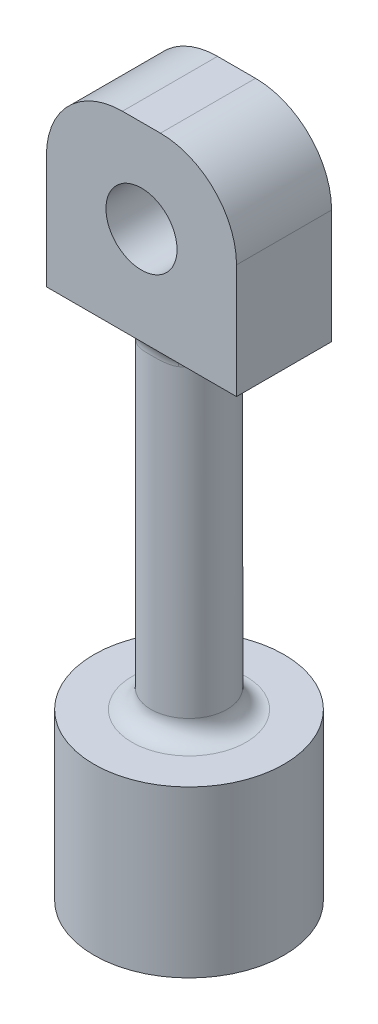
ISO-10303-21;
HEADER;
FILE_DESCRIPTION(('STEP AP214'),'2;1');
FILE_NAME('part.step','',(''),(''),'','','');
FILE_SCHEMA(('AUTOMOTIVE_DESIGN { 1 0 10303 214 1 1 1 1 }'));
ENDSEC;
DATA;
#1=APPLICATION_CONTEXT('core data for automotive mechanical design processes');
#2=APPLICATION_PROTOCOL_DEFINITION('international standard','automotive_design',2000,#1);
#3=PRODUCT_CONTEXT('',#1,'mechanical');
#4=PRODUCT('Part','Part','',(#3));
#5=PRODUCT_RELATED_PRODUCT_CATEGORY('part','',(#4));
#6=PRODUCT_DEFINITION_FORMATION('','',#4);
#7=PRODUCT_DEFINITION_CONTEXT('part definition',#1,'design');
#8=PRODUCT_DEFINITION('design','',#6,#7);
#9=PRODUCT_DEFINITION_SHAPE('','',#8);
#10=(LENGTH_UNIT() NAMED_UNIT(*) SI_UNIT(.MILLI.,.METRE.));
#11=(NAMED_UNIT(*) PLANE_ANGLE_UNIT() SI_UNIT($,.RADIAN.));
#12=(NAMED_UNIT(*) SI_UNIT($,.STERADIAN.) SOLID_ANGLE_UNIT());
#13=UNCERTAINTY_MEASURE_WITH_UNIT(LENGTH_MEASURE(1.E-05),#10,'distance_accuracy_value','');
#14=(GEOMETRIC_REPRESENTATION_CONTEXT(3) GLOBAL_UNCERTAINTY_ASSIGNED_CONTEXT((#13)) GLOBAL_UNIT_ASSIGNED_CONTEXT((#10,
#11,#12)) REPRESENTATION_CONTEXT('',''));
#15=CARTESIAN_POINT('',(0.,0.,0.));
#16=DIRECTION('',(0.,0.,1.));
#17=DIRECTION('',(1.,0.,0.));
#18=AXIS2_PLACEMENT_3D('',#15,#16,#17);
#19=CARTESIAN_POINT('',(0.,33.909,0.));
#20=DIRECTION('',(0.,-1.,0.));
#21=DIRECTION('',(0.,0.,-1.));
#22=AXIS2_PLACEMENT_3D('',#19,#20,#21);
#23=PLANE('',#22);
#24=DIRECTION('',(1.,0.,0.));
#25=VECTOR('',#24,1.);
#26=CARTESIAN_POINT('',(-6.35,33.909,3.175));
#27=LINE('',#26,#25);
#28=CARTESIAN_POINT('',(2.10605674187568,33.909,3.175));
#29=VERTEX_POINT('',#28);
#30=CARTESIAN_POINT('',(6.35,33.909,3.175));
#31=VERTEX_POINT('',#30);
#32=EDGE_CURVE('E149',#29,#31,#27,.T.);
#33=ORIENTED_EDGE('',*,*,#32,.F.);
#34=CARTESIAN_POINT('',(0.,33.909,0.));
#35=DIRECTION('',(0.,-1.,0.));
#36=DIRECTION('',(0.,0.,-1.));
#37=AXIS2_PLACEMENT_3D('',#34,#35,#36);
#38=CIRCLE('',#37,3.81);
#39=CARTESIAN_POINT('',(2.10605674187568,33.909,-3.175));
#40=VERTEX_POINT('',#39);
#41=EDGE_CURVE('E11',#29,#40,#38,.F.);
#42=ORIENTED_EDGE('',*,*,#41,.T.);
#43=DIRECTION('',(-1.,0.,0.));
#44=VECTOR('',#43,1.);
#45=CARTESIAN_POINT('',(-6.35,33.909,-3.175));
#46=LINE('',#45,#44);
#47=CARTESIAN_POINT('',(6.35,33.909,-3.175));
#48=VERTEX_POINT('',#47);
#49=EDGE_CURVE('E120',#48,#40,#46,.T.);
#50=ORIENTED_EDGE('',*,*,#49,.F.);
#51=DIRECTION('',(0.,0.,-1.));
#52=VECTOR('',#51,1.);
#53=CARTESIAN_POINT('',(6.35,33.909,3.175));
#54=LINE('',#53,#52);
#55=EDGE_CURVE('E130',#31,#48,#54,.T.);
#56=ORIENTED_EDGE('',*,*,#55,.F.);
#57=EDGE_LOOP('',(#33,#42,#50,#56));
#58=FACE_BOUND('',#57,.T.);
#59=ADVANCED_FACE('F35',(#58),#23,.T.);
#60=CARTESIAN_POINT('',(0.,11.049,0.));
#61=DIRECTION('',(0.,-1.,0.));
#62=DIRECTION('',(0.,0.,-1.));
#63=AXIS2_PLACEMENT_3D('',#60,#61,#62);
#64=CYLINDRICAL_SURFACE('',#63,6.35);
#65=CARTESIAN_POINT('',(0.,11.049,0.));
#66=DIRECTION('',(0.,1.,0.));
#67=DIRECTION('',(0.,0.,1.));
#68=AXIS2_PLACEMENT_3D('',#65,#66,#67);
#69=CIRCLE('',#68,6.35);
#70=CARTESIAN_POINT('',(0.,11.049,6.35));
#71=VERTEX_POINT('',#70);
#72=EDGE_CURVE('E160',#71,#71,#69,.T.);
#73=ORIENTED_EDGE('',*,*,#72,.F.);
#74=EDGE_LOOP('',(#73));
#75=FACE_BOUND('',#74,.T.);
#76=CARTESIAN_POINT('',(0.,0.,0.));
#77=DIRECTION('',(0.,1.,0.));
#78=DIRECTION('',(0.,0.,1.));
#79=AXIS2_PLACEMENT_3D('',#76,#77,#78);
#80=CIRCLE('',#79,6.35);
#81=CARTESIAN_POINT('',(0.,0.,6.35));
#82=VERTEX_POINT('',#81);
#83=EDGE_CURVE('E126',#82,#82,#80,.T.);
#84=ORIENTED_EDGE('',*,*,#83,.T.);
#85=EDGE_LOOP('',(#84));
#86=FACE_BOUND('',#85,.T.);
#87=ADVANCED_FACE('F308',(#75,#86),#64,.T.);
#88=CARTESIAN_POINT('',(0.,11.049,0.));
#89=DIRECTION('',(0.,1.,0.));
#90=DIRECTION('',(0.,0.,1.));
#91=AXIS2_PLACEMENT_3D('',#88,#89,#90);
#92=PLANE('',#91);
#93=CARTESIAN_POINT('',(0.,11.049,0.));
#94=DIRECTION('',(0.,1.,0.));
#95=DIRECTION('',(0.,0.,1.));
#96=AXIS2_PLACEMENT_3D('',#93,#94,#95);
#97=CIRCLE('',#96,3.81);
#98=CARTESIAN_POINT('',(0.,11.049,3.81));
#99=VERTEX_POINT('',#98);
#100=EDGE_CURVE('E271',#99,#99,#97,.F.);
#101=ORIENTED_EDGE('',*,*,#100,.T.);
#102=EDGE_LOOP('',(#101));
#103=FACE_BOUND('',#102,.T.);
#104=ORIENTED_EDGE('',*,*,#72,.T.);
#105=EDGE_LOOP('',(#104));
#106=FACE_BOUND('',#105,.T.);
#107=ADVANCED_FACE('F312',(#103,#106),#92,.T.);
#108=CARTESIAN_POINT('',(0.,0.,0.));
#109=DIRECTION('',(0.,1.,0.));
#110=DIRECTION('',(0.,0.,1.));
#111=AXIS2_PLACEMENT_3D('',#108,#109,#110);
#112=PLANE('',#111);
#113=ORIENTED_EDGE('',*,*,#83,.F.);
#114=EDGE_LOOP('',(#113));
#115=FACE_BOUND('',#114,.T.);
#116=ADVANCED_FACE('F318',(#115),#112,.F.);
#117=CARTESIAN_POINT('',(0.,33.909,0.));
#118=DIRECTION('',(0.,-1.,0.));
#119=DIRECTION('',(0.,0.,-1.));
#120=AXIS2_PLACEMENT_3D('',#117,#118,#119);
#121=CYLINDRICAL_SURFACE('',#120,2.54);
#122=CARTESIAN_POINT('',(0.,12.319,0.));
#123=DIRECTION('',(0.,1.,0.));
#124=DIRECTION('',(0.,0.,1.));
#125=AXIS2_PLACEMENT_3D('',#122,#123,#124);
#126=CIRCLE('',#125,2.54);
#127=CARTESIAN_POINT('',(0.,12.319,2.54));
#128=VERTEX_POINT('',#127);
#129=EDGE_CURVE('E274',#128,#128,#126,.T.);
#130=ORIENTED_EDGE('',*,*,#129,.T.);
#131=EDGE_LOOP('',(#130));
#132=FACE_BOUND('',#131,.T.);
#133=CARTESIAN_POINT('',(-2.75747346033165,33.909,3.175));
#134=CARTESIAN_POINT('',(-1.45075360666102,34.3925103205279,2.15924582636556));
#135=CARTESIAN_POINT('',(-1.8383156402211,32.762287335359,1.75276798433748));
#136=CARTESIAN_POINT('',(-2.72145797705879,33.909,3.175));
#137=CARTESIAN_POINT('',(-1.4619449534235,34.3627104337745,2.1364571380609));
#138=CARTESIAN_POINT('',(-1.81430531803398,32.7443061096109,1.77796123271911));
#139=CARTESIAN_POINT('',(-2.68412922378728,33.909,3.175));
#140=CARTESIAN_POINT('',(-1.47073248027829,34.3306632550964,2.11840312635964));
#141=CARTESIAN_POINT('',(-1.78941948251894,32.7287001018676,1.80301384779414));
#142=CARTESIAN_POINT('',(-2.60721213015224,33.909,3.175));
#143=CARTESIAN_POINT('',(-1.48263257214973,34.2651764844754,2.09138260314045));
#144=CARTESIAN_POINT('',(-1.73814142009749,32.7017579648089,1.85249078486686));
#145=CARTESIAN_POINT('',(-2.56762839040957,33.909,3.175));
#146=CARTESIAN_POINT('',(-1.48588018624446,34.231802792635,2.08220364788548));
#147=CARTESIAN_POINT('',(-1.71175226027164,32.6904134767656,1.87691624833565));
#148=CARTESIAN_POINT('',(-2.44674360913777,33.909,3.175));
#149=CARTESIAN_POINT('',(-1.48674334836591,34.1346097553019,2.06657196841838));
#150=CARTESIAN_POINT('',(-1.63116240609462,32.6621789642376,1.94833753668744));
#151=CARTESIAN_POINT('',(-2.3624790921311,33.909,3.175));
#152=CARTESIAN_POINT('',(-1.47653785253469,34.0706978369796,2.07020606843899));
#153=CARTESIAN_POINT('',(-1.57498606142162,32.6507044916589,1.99406237736209));
#154=CARTESIAN_POINT('',(-2.1410703829851,33.909,3.175));
#155=CARTESIAN_POINT('',(-1.42414088680289,33.9257559973822,2.10221098403041));
#156=CARTESIAN_POINT('',(-1.42738025532204,32.6351701860049,2.10395038816791));
#157=CARTESIAN_POINT('',(-1.99982997151836,33.909,3.175));
#158=CARTESIAN_POINT('',(-1.36923366618578,33.8496502471815,2.14127021575293));
#159=CARTESIAN_POINT('',(-1.33321998101189,32.6384013643611,2.16482858767716));
#160=CARTESIAN_POINT('',(-1.70667074867858,33.909,3.175));
#161=CARTESIAN_POINT('',(-1.22391730797736,33.7301349698206,2.22907432847525));
#162=CARTESIAN_POINT('',(-1.13778049911941,32.6583169592671,2.27370249296661));
#163=CARTESIAN_POINT('',(-1.55468546483664,33.909,3.175));
#164=CARTESIAN_POINT('',(-1.13434514523384,33.684666092897,2.27783580065136));
#165=CARTESIAN_POINT('',(-1.0364569765578,32.6750933064768,2.32160717117294));
#166=CARTESIAN_POINT('',(-1.23295718880419,33.909,3.175));
#167=CARTESIAN_POINT('',(-0.926866541861878,33.6155588797758,2.37010033517938));
#168=CARTESIAN_POINT('',(-0.821971459202746,32.7136356489396,2.40625619806118));
#169=CARTESIAN_POINT('',(-1.06270036998937,33.909,3.175));
#170=CARTESIAN_POINT('',(-0.806864110490199,33.5919187450191,2.41413776676252));
#171=CARTESIAN_POINT('',(-0.708466913326458,32.7356524902216,2.44208870148717));
#172=CARTESIAN_POINT('',(-0.802850613272052,33.909,3.175));
#173=CARTESIAN_POINT('',(-0.615600478159449,33.5681089924189,2.46650168060618));
#174=CARTESIAN_POINT('',(-0.535233742181263,32.7642961639842,2.48367535672255));
#175=CARTESIAN_POINT('',(-0.715600296142355,33.909,3.175));
#176=CARTESIAN_POINT('',(-0.550403207057634,33.5620685227564,2.48168354496009));
#177=CARTESIAN_POINT('',(-0.477066864094577,32.7731056136815,2.49550343318059));
#178=CARTESIAN_POINT('',(-0.539873346842567,33.909,3.175));
#179=CARTESIAN_POINT('',(-0.417599545586189,33.5527188341097,2.50699110839662));
#180=CARTESIAN_POINT('',(-0.359915564561385,32.7882674505011,2.51507142565873));
#181=CARTESIAN_POINT('',(-0.451397155316292,33.909,3.175));
#182=CARTESIAN_POINT('',(-0.349770975763571,33.5493668970072,2.51721062537906));
#183=CARTESIAN_POINT('',(-0.300931436877421,32.7946206979351,2.52281277344814));
#184=CARTESIAN_POINT('',(-0.257633820372503,33.909,3.175));
#185=CARTESIAN_POINT('',(-0.200522190156591,33.5442223062246,2.53350557205262));
#186=CARTESIAN_POINT('',(-0.171755880248458,32.8049249501876,2.53515927163514));
#187=CARTESIAN_POINT('',(-0.15219154289603,33.909,3.175));
#188=CARTESIAN_POINT('',(-0.118388680708994,33.5427881251985,2.53859571542163));
#189=CARTESIAN_POINT('',(-0.101461028597439,32.808236395569,2.53894743153238));
#190=CARTESIAN_POINT('',(0.0588439476512445,33.909,3.175));
#191=CARTESIAN_POINT('',(0.0457236454247861,33.5421241175975,2.54089515488794));
#192=CARTESIAN_POINT('',(0.0392292984342487,32.8097290540229,2.54067137423043));
#193=CARTESIAN_POINT('',(0.164437172904386,33.909,3.175));
#194=CARTESIAN_POINT('',(0.128144441372206,33.5428909457727,2.53811621016374));
#195=CARTESIAN_POINT('',(0.109624781936478,32.8079098265766,2.53860665450393));
#196=CARTESIAN_POINT('',(0.375134437884289,33.909,3.175));
#197=CARTESIAN_POINT('',(0.291191200794401,33.5469030657575,2.52489593997202));
#198=CARTESIAN_POINT('',(0.250089625255972,32.7994527065369,2.52864167150419));
#199=CARTESIAN_POINT('',(0.480235902219539,33.909,3.175));
#200=CARTESIAN_POINT('',(0.372241171557344,33.5501784384892,2.51435942355359));
#201=CARTESIAN_POINT('',(0.320157268145559,32.7927997086069,2.52072311386589));
#202=CARTESIAN_POINT('',(0.688772361635576,33.909,3.175));
#203=CARTESIAN_POINT('',(0.530475009564656,33.5602337205924,2.48633248453244));
#204=CARTESIAN_POINT('',(0.459181574423796,32.7758264506634,2.49914052659052));
#205=CARTESIAN_POINT('',(0.792207253663054,33.909,3.175));
#206=CARTESIAN_POINT('',(0.608039298474719,33.5670759119238,2.468697060834));
#207=CARTESIAN_POINT('',(0.528138169110239,32.7655059647719,2.48547614306246));
#208=CARTESIAN_POINT('',(1.08102047728345,33.909,3.175));
#209=CARTESIAN_POINT('',(0.820428628133336,33.5937840228559,2.41018525109081));
#210=CARTESIAN_POINT('',(0.720680318186171,32.7335645468445,2.43897203089037));
#211=CARTESIAN_POINT('',(1.26383869884293,33.909,3.175));
#212=CARTESIAN_POINT('',(0.948845354349257,33.6200650298272,2.36181615097928));
#213=CARTESIAN_POINT('',(0.842559132546411,32.7096298567921,2.39960403191938));
#214=CARTESIAN_POINT('',(1.61836923396855,33.909,3.175));
#215=CARTESIAN_POINT('',(1.17397398571186,33.7015655950387,2.25823492815116));
#216=CARTESIAN_POINT('',(1.07891282266116,32.6678481808692,2.3029852734753));
#217=CARTESIAN_POINT('',(1.79013250310725,33.909,3.175));
#218=CARTESIAN_POINT('',(1.27118984233523,33.7587127825564,2.20186556768394));
#219=CARTESIAN_POINT('',(1.19342166879709,32.6499713570588,2.24582490508662));
#220=CARTESIAN_POINT('',(2.0566142211182,33.909,3.175));
#221=CARTESIAN_POINT('',(1.38914589027986,33.8803251554777,2.12717702306518));
#222=CARTESIAN_POINT('',(1.37107614737573,32.6380108959743,2.13962315517979));
#223=CARTESIAN_POINT('',(2.15568332115344,33.909,3.175));
#224=CARTESIAN_POINT('',(1.42513559033852,33.9356213641979,2.10219868982999));
#225=CARTESIAN_POINT('',(1.43712221399043,32.6374439142818,2.09583194074454));
#226=CARTESIAN_POINT('',(2.29937534719872,33.909,3.175));
#227=CARTESIAN_POINT('',(1.46182244061619,34.0274930819406,2.07900024101459));
#228=CARTESIAN_POINT('',(1.53291689806266,32.6458611282743,2.02567263231361));
#229=CARTESIAN_POINT('',(2.34662112284787,33.909,3.175));
#230=CARTESIAN_POINT('',(1.47119060673998,34.0604137288786,2.07367961547336));
#231=CARTESIAN_POINT('',(1.56441408186909,32.6502454036791,2.00144186745873));
#232=CARTESIAN_POINT('',(2.43913130996258,33.909,3.175));
#233=CARTESIAN_POINT('',(1.48366955631215,34.1286792504366,2.06969009583306));
#234=CARTESIAN_POINT('',(1.62608753999992,32.6627751978397,1.95167075755933));
#235=CARTESIAN_POINT('',(2.48439247491016,33.909,3.175));
#236=CARTESIAN_POINT('',(1.48661398449224,34.1640913822208,2.07119839725305));
#237=CARTESIAN_POINT('',(1.65626164997896,32.6709266449294,1.92612840501469));
#238=CARTESIAN_POINT('',(2.52848744698442,33.909,3.175));
#239=CARTESIAN_POINT('',(1.48616480332682,34.1995970549083,2.07702560245629));
#240=CARTESIAN_POINT('',(1.68565829798961,32.6812724046579,1.90004107913981));
#241=(BOUNDED_SURFACE() B_SPLINE_SURFACE(3,2,((#133,#134,#135),(#136,#137,#138),(#139,#140,
#141),(#142,#143,#144),(#145,#146,#147),(#148,#149,#150),(#151,#152,#153),(#154,#155,#156),
(#157,#158,#159),(#160,#161,#162),(#163,#164,#165),(#166,#167,#168),(#169,#170,#171),(#172,#173,
#174),(#175,#176,#177),(#178,#179,#180),(#181,#182,#183),(#184,#185,#186),(#187,#188,#189),
(#190,#191,#192),(#193,#194,#195),(#196,#197,#198),(#199,#200,#201),(#202,#203,#204),(#205,#206,
#207),(#208,#209,#210),(#211,#212,#213),(#214,#215,#216),(#217,#218,#219),(#220,#221,#222),
(#223,#224,#225),(#226,#227,#228),(#229,#230,#231),(#232,#233,#234),(#235,#236,#237),(#238,#239,
#240)),.UNSPECIFIED.,.F.,.F.,.F.) B_SPLINE_SURFACE_WITH_KNOTS((4,2,2,2,2,2,2,2,2,2,2,2,2,2,2,2,
2,4),(3,3),(0.,0.165478964280866,0.330631634870747,0.657187123329499,1.15911064900215,
1.6644696405109,2.20221153747686,2.47042166305055,2.73853775979549,3.05498965599523,
3.37146872352752,3.68894105243304,4.00643293763199,4.58500515335889,5.16068472701099,
5.51628394310174,5.69542592105601,5.87485077670779),(0.,1.),
.UNSPECIFIED.) GEOMETRIC_REPRESENTATION_ITEM() RATIONAL_B_SPLINE_SURFACE(((1.,0.593046572981363,
1.),(1.,0.599903529057048,1.),(1.,0.606980350720252,1.),(1.,0.621392399509858,1.),(1.,
0.628727089593793,1.),(1.,0.650721583165667,1.),(1.,0.665534782996795,1.),(1.,0.702309478093336,
1.),(1.,0.723837732724251,1.),(1.,0.763359635592699,1.),(1.,0.781328082295264,1.),(1.,
0.81353929178972,1.),(1.,0.827469535836317,1.),(1.,0.84375223507824,1.),(1.,0.848408111753961,
1.),(1.,0.856131724328274,1.),(1.,0.859200016423386,1.),(1.,0.864098930789858,1.),(1.,
0.865606705247396,1.),(1.,0.866292473729694,1.),(1.,0.865470267702701,1.),(1.,0.861511666313443,
1.),(1.,0.858368016026511,1.),(1.,0.849840328339414,1.),(1.,0.844456152943346,1.),(1.,
0.826251623547143,1.),(1.,0.810957187187147,1.),(1.,0.774307157851412,1.),(1.,0.752982250667473,
1.),(1.,0.715018996161015,1.),(1.,0.699705643124637,1.),(1.,0.676076182482073,1.),(1.,
0.668058615733603,1.),(1.,0.651959945216799,1.),(1.,0.643878761110568,1.),(1.,0.635848556141678,1.))) REPRESENTATION_ITEM('') SURFACE());
#242=CARTESIAN_POINT('',(1.68565829798961,32.6812724046579,1.90004107913981));
#243=CARTESIAN_POINT('',(1.65626164997896,32.6709266449294,1.92612840501469));
#244=CARTESIAN_POINT('',(1.62608753999992,32.6627751978397,1.95167075755933));
#245=CARTESIAN_POINT('',(1.56441408186909,32.6502454036791,2.00144186745873));
#246=CARTESIAN_POINT('',(1.53291689806266,32.6458611282743,2.02567263231361));
#247=CARTESIAN_POINT('',(1.43712221399043,32.6374439142818,2.09583194074454));
#248=CARTESIAN_POINT('',(1.37107614737573,32.6380108959743,2.13962315517979));
#249=CARTESIAN_POINT('',(1.19342166879709,32.6499713570588,2.24582490508662));
#250=CARTESIAN_POINT('',(1.07891282266116,32.6678481808692,2.3029852734753));
#251=CARTESIAN_POINT('',(0.842559132546411,32.7096298567921,2.39960403191938));
#252=CARTESIAN_POINT('',(0.720680318186171,32.7335645468445,2.43897203089037));
#253=CARTESIAN_POINT('',(0.528138169110239,32.7655059647719,2.48547614306246));
#254=CARTESIAN_POINT('',(0.459181574423796,32.7758264506634,2.49914052659052));
#255=CARTESIAN_POINT('',(0.320157268145559,32.7927997086069,2.52072311386589));
#256=CARTESIAN_POINT('',(0.250089625255972,32.7994527065369,2.52864167150419));
#257=CARTESIAN_POINT('',(0.109624781936478,32.8079098265766,2.53860665450393));
#258=CARTESIAN_POINT('',(0.0392292984342487,32.8097290540229,2.54067137423043));
#259=CARTESIAN_POINT('',(-0.101461028597439,32.808236395569,2.53894743153238));
#260=CARTESIAN_POINT('',(-0.171755880248457,32.8049249501876,2.53515927163514));
#261=CARTESIAN_POINT('',(-0.300931436877421,32.7946206979351,2.52281277344814));
#262=CARTESIAN_POINT('',(-0.359915564561385,32.7882674505011,2.51507142565873));
#263=CARTESIAN_POINT('',(-0.477066864094577,32.7731056136815,2.49550343318059));
#264=CARTESIAN_POINT('',(-0.535233742181264,32.7642961639842,2.48367535672255));
#265=CARTESIAN_POINT('',(-0.708466913326458,32.7356524902216,2.44208870148717));
#266=CARTESIAN_POINT('',(-0.821971459202746,32.7136356489396,2.40625619806118));
#267=CARTESIAN_POINT('',(-1.0364569765578,32.6750933064768,2.32160717117294));
#268=CARTESIAN_POINT('',(-1.13778049911941,32.6583169592671,2.27370249296661));
#269=CARTESIAN_POINT('',(-1.33321998101189,32.6384013643611,2.16482858767716));
#270=CARTESIAN_POINT('',(-1.42738025532204,32.6351701860049,2.10395038816791));
#271=CARTESIAN_POINT('',(-1.57498606142162,32.6507044916589,1.99406237736209));
#272=CARTESIAN_POINT('',(-1.63116240609462,32.6621789642376,1.94833753668744));
#273=CARTESIAN_POINT('',(-1.71175226027164,32.6904134767656,1.87691624833565));
#274=CARTESIAN_POINT('',(-1.73814142009749,32.7017579648089,1.85249078486686));
#275=CARTESIAN_POINT('',(-1.78941948251894,32.7287001018676,1.80301384779414));
#276=CARTESIAN_POINT('',(-1.81430531803398,32.7443061096109,1.77796123271911));
#277=CARTESIAN_POINT('',(-1.8383156402211,32.762287335359,1.75276798433748));
#278=B_SPLINE_CURVE_WITH_KNOTS('',3,(#242,#243,#244,#245,#246,#247,#248,#249,#250,#251,#252,
#253,#254,#255,#256,#257,#258,#259,#260,#261,#262,#263,#264,#265,#266,#267,#268,#269,#270,#271,
#272,#273,#274,#275,#276,#277),.UNSPECIFIED.,.F.,.F.,(4,2,2,2,2,2,2,2,2,2,2,2,2,2,2,2,2,4),(0.,
0.17942485565178,0.358566833606048,0.714166049696798,1.2898456233489,1.86841783907579,
2.18590972427475,2.50338205318026,2.81986112071256,3.13631301691229,3.40442911365723,
3.67263923923093,4.21038113619688,4.71574012770563,5.21766365337829,5.54421914183704,
5.70937181242692,5.87485077670779),.UNSPECIFIED.);
#279=CARTESIAN_POINT('',(1.40403782791712,32.639,2.11666666666667));
#280=VERTEX_POINT('',#279);
#281=CARTESIAN_POINT('',(-1.40403782791712,32.639,2.11666666666667));
#282=VERTEX_POINT('',#281);
#283=EDGE_CURVE('E182',#280,#282,#278,.T.);
#284=ORIENTED_EDGE('',*,*,#283,.T.);
#285=CARTESIAN_POINT('',(0.,32.639,0.));
#286=DIRECTION('',(0.,-1.,0.));
#287=DIRECTION('',(0.,0.,-1.));
#288=AXIS2_PLACEMENT_3D('',#285,#286,#287);
#289=CIRCLE('',#288,2.54);
#290=CARTESIAN_POINT('',(-1.40403782791712,32.639,-2.11666666666667));
#291=VERTEX_POINT('',#290);
#292=EDGE_CURVE('E277',#282,#291,#289,.T.);
#293=ORIENTED_EDGE('',*,*,#292,.T.);
#294=CARTESIAN_POINT('',(2.75747346033165,33.909,-3.175));
#295=CARTESIAN_POINT('',(1.45075360666102,34.3925103205279,-2.15924582636556));
#296=CARTESIAN_POINT('',(1.8383156402211,32.762287335359,-1.75276798433748));
#297=CARTESIAN_POINT('',(2.72145797705879,33.909,-3.175));
#298=CARTESIAN_POINT('',(1.4619449534235,34.3627104337745,-2.1364571380609));
#299=CARTESIAN_POINT('',(1.81430531803398,32.7443061096109,-1.77796123271911));
#300=CARTESIAN_POINT('',(2.68412922378728,33.909,-3.175));
#301=CARTESIAN_POINT('',(1.47073248027829,34.3306632550964,-2.11840312635964));
#302=CARTESIAN_POINT('',(1.78941948251894,32.7287001018676,-1.80301384779414));
#303=CARTESIAN_POINT('',(2.60721213015224,33.909,-3.175));
#304=CARTESIAN_POINT('',(1.48263257214973,34.2651764844754,-2.09138260314045));
#305=CARTESIAN_POINT('',(1.73814142009749,32.7017579648089,-1.85249078486686));
#306=CARTESIAN_POINT('',(2.56762839040957,33.909,-3.175));
#307=CARTESIAN_POINT('',(1.48588018624446,34.231802792635,-2.08220364788548));
#308=CARTESIAN_POINT('',(1.71175226027164,32.6904134767656,-1.87691624833565));
#309=CARTESIAN_POINT('',(2.44674360913777,33.909,-3.175));
#310=CARTESIAN_POINT('',(1.48674334836591,34.1346097553019,-2.06657196841838));
#311=CARTESIAN_POINT('',(1.63116240609462,32.6621789642376,-1.94833753668744));
#312=CARTESIAN_POINT('',(2.3624790921311,33.909,-3.175));
#313=CARTESIAN_POINT('',(1.47653785253469,34.0706978369796,-2.07020606843899));
#314=CARTESIAN_POINT('',(1.57498606142162,32.6507044916589,-1.99406237736209));
#315=CARTESIAN_POINT('',(2.1410703829851,33.909,-3.175));
#316=CARTESIAN_POINT('',(1.42414088680289,33.9257559973822,-2.10221098403041));
#317=CARTESIAN_POINT('',(1.42738025532204,32.6351701860049,-2.10395038816791));
#318=CARTESIAN_POINT('',(1.99982997151836,33.909,-3.175));
#319=CARTESIAN_POINT('',(1.36923366618578,33.8496502471815,-2.14127021575293));
#320=CARTESIAN_POINT('',(1.33321998101189,32.6384013643611,-2.16482858767716));
#321=CARTESIAN_POINT('',(1.70667074867858,33.909,-3.175));
#322=CARTESIAN_POINT('',(1.22391730797736,33.7301349698206,-2.22907432847525));
#323=CARTESIAN_POINT('',(1.13778049911941,32.6583169592671,-2.27370249296661));
#324=CARTESIAN_POINT('',(1.55468546483664,33.909,-3.175));
#325=CARTESIAN_POINT('',(1.13434514523384,33.684666092897,-2.27783580065136));
#326=CARTESIAN_POINT('',(1.0364569765578,32.6750933064768,-2.32160717117294));
#327=CARTESIAN_POINT('',(1.23295718880419,33.909,-3.175));
#328=CARTESIAN_POINT('',(0.926866541861878,33.6155588797758,-2.37010033517938));
#329=CARTESIAN_POINT('',(0.821971459202746,32.7136356489396,-2.40625619806118));
#330=CARTESIAN_POINT('',(1.06270036998937,33.909,-3.175));
#331=CARTESIAN_POINT('',(0.806864110490199,33.5919187450191,-2.41413776676252));
#332=CARTESIAN_POINT('',(0.708466913326458,32.7356524902216,-2.44208870148717));
#333=CARTESIAN_POINT('',(0.802850613272052,33.909,-3.175));
#334=CARTESIAN_POINT('',(0.615600478159449,33.5681089924189,-2.46650168060618));
#335=CARTESIAN_POINT('',(0.535233742181263,32.7642961639842,-2.48367535672255));
#336=CARTESIAN_POINT('',(0.715600296142355,33.909,-3.175));
#337=CARTESIAN_POINT('',(0.550403207057634,33.5620685227564,-2.48168354496009));
#338=CARTESIAN_POINT('',(0.477066864094577,32.7731056136815,-2.49550343318059));
#339=CARTESIAN_POINT('',(0.539873346842567,33.909,-3.175));
#340=CARTESIAN_POINT('',(0.417599545586189,33.5527188341097,-2.50699110839662));
#341=CARTESIAN_POINT('',(0.359915564561385,32.7882674505011,-2.51507142565873));
#342=CARTESIAN_POINT('',(0.451397155316292,33.909,-3.175));
#343=CARTESIAN_POINT('',(0.349770975763571,33.5493668970072,-2.51721062537906));
#344=CARTESIAN_POINT('',(0.300931436877421,32.7946206979351,-2.52281277344814));
#345=CARTESIAN_POINT('',(0.257633820372503,33.909,-3.175));
#346=CARTESIAN_POINT('',(0.200522190156591,33.5442223062246,-2.53350557205262));
#347=CARTESIAN_POINT('',(0.171755880248458,32.8049249501876,-2.53515927163514));
#348=CARTESIAN_POINT('',(0.15219154289603,33.909,-3.175));
#349=CARTESIAN_POINT('',(0.118388680708994,33.5427881251985,-2.53859571542163));
#350=CARTESIAN_POINT('',(0.101461028597439,32.808236395569,-2.53894743153238));
#351=CARTESIAN_POINT('',(-0.0588439476512445,33.909,-3.175));
#352=CARTESIAN_POINT('',(-0.0457236454247861,33.5421241175975,-2.54089515488794));
#353=CARTESIAN_POINT('',(-0.0392292984342487,32.8097290540229,-2.54067137423043));
#354=CARTESIAN_POINT('',(-0.164437172904386,33.909,-3.175));
#355=CARTESIAN_POINT('',(-0.128144441372206,33.5428909457727,-2.53811621016374));
#356=CARTESIAN_POINT('',(-0.109624781936478,32.8079098265766,-2.53860665450393));
#357=CARTESIAN_POINT('',(-0.375134437884289,33.909,-3.175));
#358=CARTESIAN_POINT('',(-0.291191200794401,33.5469030657575,-2.52489593997202));
#359=CARTESIAN_POINT('',(-0.250089625255972,32.7994527065369,-2.52864167150419));
#360=CARTESIAN_POINT('',(-0.480235902219539,33.909,-3.175));
#361=CARTESIAN_POINT('',(-0.372241171557344,33.5501784384892,-2.51435942355359));
#362=CARTESIAN_POINT('',(-0.320157268145559,32.7927997086069,-2.52072311386589));
#363=CARTESIAN_POINT('',(-0.688772361635576,33.909,-3.175));
#364=CARTESIAN_POINT('',(-0.530475009564656,33.5602337205924,-2.48633248453244));
#365=CARTESIAN_POINT('',(-0.459181574423796,32.7758264506634,-2.49914052659052));
#366=CARTESIAN_POINT('',(-0.792207253663054,33.909,-3.175));
#367=CARTESIAN_POINT('',(-0.608039298474719,33.5670759119238,-2.468697060834));
#368=CARTESIAN_POINT('',(-0.528138169110239,32.7655059647719,-2.48547614306246));
#369=CARTESIAN_POINT('',(-1.08102047728345,33.909,-3.175));
#370=CARTESIAN_POINT('',(-0.820428628133336,33.5937840228559,-2.41018525109081));
#371=CARTESIAN_POINT('',(-0.720680318186171,32.7335645468445,-2.43897203089037));
#372=CARTESIAN_POINT('',(-1.26383869884293,33.909,-3.175));
#373=CARTESIAN_POINT('',(-0.948845354349257,33.6200650298272,-2.36181615097928));
#374=CARTESIAN_POINT('',(-0.842559132546411,32.7096298567921,-2.39960403191938));
#375=CARTESIAN_POINT('',(-1.61836923396855,33.909,-3.175));
#376=CARTESIAN_POINT('',(-1.17397398571186,33.7015655950387,-2.25823492815116));
#377=CARTESIAN_POINT('',(-1.07891282266116,32.6678481808692,-2.3029852734753));
#378=CARTESIAN_POINT('',(-1.79013250310725,33.909,-3.175));
#379=CARTESIAN_POINT('',(-1.27118984233523,33.7587127825564,-2.20186556768394));
#380=CARTESIAN_POINT('',(-1.19342166879709,32.6499713570588,-2.24582490508662));
#381=CARTESIAN_POINT('',(-2.0566142211182,33.909,-3.175));
#382=CARTESIAN_POINT('',(-1.38914589027986,33.8803251554777,-2.12717702306518));
#383=CARTESIAN_POINT('',(-1.37107614737573,32.6380108959743,-2.13962315517979));
#384=CARTESIAN_POINT('',(-2.15568332115344,33.909,-3.175));
#385=CARTESIAN_POINT('',(-1.42513559033852,33.9356213641979,-2.10219868982999));
#386=CARTESIAN_POINT('',(-1.43712221399043,32.6374439142818,-2.09583194074454));
#387=CARTESIAN_POINT('',(-2.29937534719872,33.909,-3.175));
#388=CARTESIAN_POINT('',(-1.46182244061619,34.0274930819406,-2.07900024101459));
#389=CARTESIAN_POINT('',(-1.53291689806266,32.6458611282743,-2.02567263231361));
#390=CARTESIAN_POINT('',(-2.34662112284787,33.909,-3.175));
#391=CARTESIAN_POINT('',(-1.47119060673998,34.0604137288786,-2.07367961547336));
#392=CARTESIAN_POINT('',(-1.56441408186909,32.6502454036791,-2.00144186745873));
#393=CARTESIAN_POINT('',(-2.43913130996258,33.909,-3.175));
#394=CARTESIAN_POINT('',(-1.48366955631215,34.1286792504366,-2.06969009583306));
#395=CARTESIAN_POINT('',(-1.62608753999992,32.6627751978397,-1.95167075755933));
#396=CARTESIAN_POINT('',(-2.48439247491016,33.909,-3.175));
#397=CARTESIAN_POINT('',(-1.48661398449224,34.1640913822208,-2.07119839725305));
#398=CARTESIAN_POINT('',(-1.65626164997896,32.6709266449294,-1.92612840501469));
#399=CARTESIAN_POINT('',(-2.52848744698442,33.909,-3.175));
#400=CARTESIAN_POINT('',(-1.48616480332682,34.1995970549083,-2.07702560245629));
#401=CARTESIAN_POINT('',(-1.68565829798961,32.6812724046579,-1.90004107913981));
#402=(BOUNDED_SURFACE() B_SPLINE_SURFACE(3,2,((#294,#295,#296),(#297,#298,#299),(#300,#301,
#302),(#303,#304,#305),(#306,#307,#308),(#309,#310,#311),(#312,#313,#314),(#315,#316,#317),
(#318,#319,#320),(#321,#322,#323),(#324,#325,#326),(#327,#328,#329),(#330,#331,#332),(#333,#334,
#335),(#336,#337,#338),(#339,#340,#341),(#342,#343,#344),(#345,#346,#347),(#348,#349,#350),
(#351,#352,#353),(#354,#355,#356),(#357,#358,#359),(#360,#361,#362),(#363,#364,#365),(#366,#367,
#368),(#369,#370,#371),(#372,#373,#374),(#375,#376,#377),(#378,#379,#380),(#381,#382,#383),
(#384,#385,#386),(#387,#388,#389),(#390,#391,#392),(#393,#394,#395),(#396,#397,#398),(#399,#400,
#401)),.UNSPECIFIED.,.F.,.F.,.F.) B_SPLINE_SURFACE_WITH_KNOTS((4,2,2,2,2,2,2,2,2,2,2,2,2,2,2,2,
2,4),(3,3),(0.,0.165478964280866,0.330631634870747,0.657187123329499,1.15911064900215,
1.6644696405109,2.20221153747686,2.47042166305055,2.73853775979549,3.05498965599523,
3.37146872352752,3.68894105243304,4.00643293763199,4.58500515335889,5.16068472701099,
5.51628394310174,5.69542592105601,5.87485077670779),(0.,1.),
.UNSPECIFIED.) GEOMETRIC_REPRESENTATION_ITEM() RATIONAL_B_SPLINE_SURFACE(((1.,0.593046572981363,
1.),(1.,0.599903529057048,1.),(1.,0.606980350720252,1.),(1.,0.621392399509858,1.),(1.,
0.628727089593793,1.),(1.,0.650721583165667,1.),(1.,0.665534782996795,1.),(1.,0.702309478093336,
1.),(1.,0.723837732724251,1.),(1.,0.763359635592699,1.),(1.,0.781328082295264,1.),(1.,
0.81353929178972,1.),(1.,0.827469535836317,1.),(1.,0.84375223507824,1.),(1.,0.848408111753961,
1.),(1.,0.856131724328274,1.),(1.,0.859200016423386,1.),(1.,0.864098930789858,1.),(1.,
0.865606705247396,1.),(1.,0.866292473729694,1.),(1.,0.865470267702701,1.),(1.,0.861511666313443,
1.),(1.,0.858368016026511,1.),(1.,0.849840328339414,1.),(1.,0.844456152943346,1.),(1.,
0.826251623547143,1.),(1.,0.810957187187147,1.),(1.,0.774307157851412,1.),(1.,0.752982250667473,
1.),(1.,0.715018996161015,1.),(1.,0.699705643124637,1.),(1.,0.676076182482073,1.),(1.,
0.668058615733603,1.),(1.,0.651959945216799,1.),(1.,0.643878761110568,1.),(1.,0.635848556141678,1.))) REPRESENTATION_ITEM('') SURFACE());
#403=CARTESIAN_POINT('',(-1.68565829798961,32.6812724046579,-1.90004107913981));
#404=CARTESIAN_POINT('',(-1.65626164997896,32.6709266449294,-1.92612840501469));
#405=CARTESIAN_POINT('',(-1.62608753999992,32.6627751978397,-1.95167075755933));
#406=CARTESIAN_POINT('',(-1.56441408186909,32.6502454036791,-2.00144186745873));
#407=CARTESIAN_POINT('',(-1.53291689806266,32.6458611282743,-2.02567263231361));
#408=CARTESIAN_POINT('',(-1.43712221399043,32.6374439142818,-2.09583194074454));
#409=CARTESIAN_POINT('',(-1.37107614737573,32.6380108959743,-2.13962315517979));
#410=CARTESIAN_POINT('',(-1.19342166879709,32.6499713570588,-2.24582490508662));
#411=CARTESIAN_POINT('',(-1.07891282266116,32.6678481808692,-2.3029852734753));
#412=CARTESIAN_POINT('',(-0.842559132546411,32.7096298567921,-2.39960403191938));
#413=CARTESIAN_POINT('',(-0.720680318186171,32.7335645468445,-2.43897203089037));
#414=CARTESIAN_POINT('',(-0.528138169110239,32.7655059647719,-2.48547614306246));
#415=CARTESIAN_POINT('',(-0.459181574423796,32.7758264506634,-2.49914052659052));
#416=CARTESIAN_POINT('',(-0.320157268145559,32.7927997086069,-2.52072311386589));
#417=CARTESIAN_POINT('',(-0.250089625255972,32.7994527065369,-2.52864167150419));
#418=CARTESIAN_POINT('',(-0.109624781936478,32.8079098265766,-2.53860665450393));
#419=CARTESIAN_POINT('',(-0.0392292984342487,32.8097290540229,-2.54067137423043));
#420=CARTESIAN_POINT('',(0.101461028597439,32.808236395569,-2.53894743153238));
#421=CARTESIAN_POINT('',(0.171755880248457,32.8049249501876,-2.53515927163514));
#422=CARTESIAN_POINT('',(0.300931436877421,32.7946206979351,-2.52281277344814));
#423=CARTESIAN_POINT('',(0.359915564561385,32.7882674505011,-2.51507142565873));
#424=CARTESIAN_POINT('',(0.477066864094577,32.7731056136815,-2.49550343318059));
#425=CARTESIAN_POINT('',(0.535233742181264,32.7642961639842,-2.48367535672255));
#426=CARTESIAN_POINT('',(0.708466913326458,32.7356524902216,-2.44208870148717));
#427=CARTESIAN_POINT('',(0.821971459202746,32.7136356489396,-2.40625619806118));
#428=CARTESIAN_POINT('',(1.0364569765578,32.6750933064768,-2.32160717117294));
#429=CARTESIAN_POINT('',(1.13778049911941,32.6583169592671,-2.27370249296661));
#430=CARTESIAN_POINT('',(1.33321998101189,32.6384013643611,-2.16482858767716));
#431=CARTESIAN_POINT('',(1.42738025532204,32.6351701860049,-2.10395038816791));
#432=CARTESIAN_POINT('',(1.57498606142162,32.6507044916589,-1.99406237736209));
#433=CARTESIAN_POINT('',(1.63116240609462,32.6621789642376,-1.94833753668744));
#434=CARTESIAN_POINT('',(1.71175226027164,32.6904134767656,-1.87691624833565));
#435=CARTESIAN_POINT('',(1.73814142009749,32.7017579648089,-1.85249078486686));
#436=CARTESIAN_POINT('',(1.78941948251894,32.7287001018676,-1.80301384779414));
#437=CARTESIAN_POINT('',(1.81430531803398,32.7443061096109,-1.77796123271911));
#438=CARTESIAN_POINT('',(1.8383156402211,32.762287335359,-1.75276798433748));
#439=B_SPLINE_CURVE_WITH_KNOTS('',3,(#403,#404,#405,#406,#407,#408,#409,#410,#411,#412,#413,
#414,#415,#416,#417,#418,#419,#420,#421,#422,#423,#424,#425,#426,#427,#428,#429,#430,#431,#432,
#433,#434,#435,#436,#437,#438),.UNSPECIFIED.,.F.,.F.,(4,2,2,2,2,2,2,2,2,2,2,2,2,2,2,2,2,4),(0.,
0.17942485565178,0.358566833606048,0.714166049696798,1.2898456233489,1.86841783907579,
2.18590972427475,2.50338205318026,2.81986112071256,3.13631301691229,3.40442911365723,
3.67263923923093,4.21038113619688,4.71574012770563,5.21766365337829,5.54421914183704,
5.70937181242692,5.87485077670779),.UNSPECIFIED.);
#440=CARTESIAN_POINT('',(1.40403782791712,32.639,-2.11666666666667));
#441=VERTEX_POINT('',#440);
#442=EDGE_CURVE('E278',#291,#441,#439,.T.);
#443=ORIENTED_EDGE('',*,*,#442,.T.);
#444=CARTESIAN_POINT('',(0.,32.639,0.));
#445=DIRECTION('',(0.,-1.,0.));
#446=DIRECTION('',(0.,0.,-1.));
#447=AXIS2_PLACEMENT_3D('',#444,#445,#446);
#448=CIRCLE('',#447,2.54);
#449=EDGE_CURVE('E191',#441,#280,#448,.T.);
#450=ORIENTED_EDGE('',*,*,#449,.T.);
#451=EDGE_LOOP('',(#284,#293,#443,#450));
#452=FACE_BOUND('',#451,.T.);
#453=ADVANCED_FACE('F193',(#132,#452),#121,.T.);
#454=CARTESIAN_POINT('',(6.35,46.609,3.175));
#455=DIRECTION('',(-1.,0.,0.));
#456=DIRECTION('',(0.,0.,1.));
#457=AXIS2_PLACEMENT_3D('',#454,#455,#456);
#458=PLANE('',#457);
#459=DIRECTION('',(0.,-1.,0.));
#460=VECTOR('',#459,1.);
#461=CARTESIAN_POINT('',(6.35,46.609,-3.175));
#462=LINE('',#461,#460);
#463=CARTESIAN_POINT('',(6.35,41.529,-3.175));
#464=VERTEX_POINT('',#463);
#465=EDGE_CURVE('E117',#464,#48,#462,.T.);
#466=ORIENTED_EDGE('',*,*,#465,.F.);
#467=DIRECTION('',(0.,0.,-1.));
#468=VECTOR('',#467,1.);
#469=CARTESIAN_POINT('',(6.35,41.529,3.175));
#470=LINE('',#469,#468);
#471=CARTESIAN_POINT('',(6.35,41.529,3.175));
#472=VERTEX_POINT('',#471);
#473=EDGE_CURVE('E174',#464,#472,#470,.F.);
#474=ORIENTED_EDGE('',*,*,#473,.T.);
#475=DIRECTION('',(0.,-1.,0.));
#476=VECTOR('',#475,1.);
#477=CARTESIAN_POINT('',(6.35,46.609,3.175));
#478=LINE('',#477,#476);
#479=EDGE_CURVE('E137',#472,#31,#478,.T.);
#480=ORIENTED_EDGE('',*,*,#479,.T.);
#481=ORIENTED_EDGE('',*,*,#55,.T.);
#482=EDGE_LOOP('',(#466,#474,#480,#481));
#483=FACE_BOUND('',#482,.T.);
#484=ADVANCED_FACE('F135',(#483),#458,.F.);
#485=CARTESIAN_POINT('',(-6.35,46.609,-3.175));
#486=DIRECTION('',(0.,0.,1.));
#487=DIRECTION('',(1.,0.,0.));
#488=AXIS2_PLACEMENT_3D('',#485,#486,#487);
#489=PLANE('',#488);
#490=CARTESIAN_POINT('',(0.,40.4270482980582,-3.175));
#491=DIRECTION('',(0.,0.,1.));
#492=DIRECTION('',(1.,0.,0.));
#493=AXIS2_PLACEMENT_3D('',#490,#491,#492);
#494=CIRCLE('',#493,2.3749);
#495=CARTESIAN_POINT('',(2.3749,40.4270482980582,-3.175));
#496=VERTEX_POINT('',#495);
#497=EDGE_CURVE('E138',#496,#496,#494,.T.);
#498=ORIENTED_EDGE('',*,*,#497,.T.);
#499=EDGE_LOOP('',(#498));
#500=FACE_BOUND('',#499,.T.);
#501=DIRECTION('',(-1.,0.,0.));
#502=VECTOR('',#501,1.);
#503=CARTESIAN_POINT('',(-6.35,46.609,-3.175));
#504=LINE('',#503,#502);
#505=CARTESIAN_POINT('',(1.27,46.609,-3.175));
#506=VERTEX_POINT('',#505);
#507=CARTESIAN_POINT('',(-1.27,46.609,-3.175));
#508=VERTEX_POINT('',#507);
#509=EDGE_CURVE('E153',#506,#508,#504,.T.);
#510=ORIENTED_EDGE('',*,*,#509,.F.);
#511=CARTESIAN_POINT('',(1.27,41.529,-3.175));
#512=DIRECTION('',(0.,0.,1.));
#513=DIRECTION('',(1.,0.,0.));
#514=AXIS2_PLACEMENT_3D('',#511,#512,#513);
#515=CIRCLE('',#514,5.08);
#516=EDGE_CURVE('E122',#506,#464,#515,.F.);
#517=ORIENTED_EDGE('',*,*,#516,.T.);
#518=ORIENTED_EDGE('',*,*,#465,.T.);
#519=ORIENTED_EDGE('',*,*,#49,.T.);
#520=CARTESIAN_POINT('',(-2.10605674187568,33.909,-3.175));
#521=VERTEX_POINT('',#520);
#522=EDGE_CURVE('E132',#40,#521,#46,.T.);
#523=ORIENTED_EDGE('',*,*,#522,.T.);
#524=CARTESIAN_POINT('',(-6.35,33.909,-3.175));
#525=VERTEX_POINT('',#524);
#526=EDGE_CURVE('E56',#521,#525,#46,.T.);
#527=ORIENTED_EDGE('',*,*,#526,.T.);
#528=DIRECTION('',(0.,-1.,0.));
#529=VECTOR('',#528,1.);
#530=CARTESIAN_POINT('',(-6.35,46.609,-3.175));
#531=LINE('',#530,#529);
#532=CARTESIAN_POINT('',(-6.35,41.529,-3.175));
#533=VERTEX_POINT('',#532);
#534=EDGE_CURVE('E127',#533,#525,#531,.T.);
#535=ORIENTED_EDGE('',*,*,#534,.F.);
#536=CARTESIAN_POINT('',(-1.27,41.529,-3.175));
#537=DIRECTION('',(0.,0.,1.));
#538=DIRECTION('',(1.,0.,0.));
#539=AXIS2_PLACEMENT_3D('',#536,#537,#538);
#540=CIRCLE('',#539,5.08);
#541=EDGE_CURVE('E171',#533,#508,#540,.F.);
#542=ORIENTED_EDGE('',*,*,#541,.T.);
#543=EDGE_LOOP('',(#510,#517,#518,#519,#523,#527,#535,#542));
#544=FACE_BOUND('',#543,.T.);
#545=ADVANCED_FACE('F119',(#500,#544),#489,.F.);
#546=CARTESIAN_POINT('',(-6.35,46.609,3.175));
#547=DIRECTION('',(1.,0.,0.));
#548=DIRECTION('',(0.,0.,-1.));
#549=AXIS2_PLACEMENT_3D('',#546,#547,#548);
#550=PLANE('',#549);
#551=DIRECTION('',(0.,-1.,0.));
#552=VECTOR('',#551,1.);
#553=CARTESIAN_POINT('',(-6.35,46.609,3.175));
#554=LINE('',#553,#552);
#555=CARTESIAN_POINT('',(-6.35,41.529,3.175));
#556=VERTEX_POINT('',#555);
#557=CARTESIAN_POINT('',(-6.35,33.909,3.175));
#558=VERTEX_POINT('',#557);
#559=EDGE_CURVE('E156',#556,#558,#554,.T.);
#560=ORIENTED_EDGE('',*,*,#559,.F.);
#561=DIRECTION('',(0.,0.,1.));
#562=VECTOR('',#561,1.);
#563=CARTESIAN_POINT('',(-6.35,41.529,3.175));
#564=LINE('',#563,#562);
#565=EDGE_CURVE('E180',#556,#533,#564,.F.);
#566=ORIENTED_EDGE('',*,*,#565,.T.);
#567=ORIENTED_EDGE('',*,*,#534,.T.);
#568=DIRECTION('',(0.,0.,1.));
#569=VECTOR('',#568,1.);
#570=CARTESIAN_POINT('',(-6.35,33.909,3.175));
#571=LINE('',#570,#569);
#572=EDGE_CURVE('E131',#525,#558,#571,.T.);
#573=ORIENTED_EDGE('',*,*,#572,.T.);
#574=EDGE_LOOP('',(#560,#566,#567,#573));
#575=FACE_BOUND('',#574,.T.);
#576=ADVANCED_FACE('F294',(#575),#550,.F.);
#577=CARTESIAN_POINT('',(-6.35,46.609,3.175));
#578=DIRECTION('',(0.,0.,-1.));
#579=DIRECTION('',(-1.,0.,0.));
#580=AXIS2_PLACEMENT_3D('',#577,#578,#579);
#581=PLANE('',#580);
#582=CARTESIAN_POINT('',(0.,40.4270482980582,3.175));
#583=DIRECTION('',(0.,0.,1.));
#584=DIRECTION('',(1.,0.,0.));
#585=AXIS2_PLACEMENT_3D('',#582,#583,#584);
#586=CIRCLE('',#585,2.3749);
#587=CARTESIAN_POINT('',(2.3749,40.4270482980582,3.175));
#588=VERTEX_POINT('',#587);
#589=EDGE_CURVE('E141',#588,#588,#586,.T.);
#590=ORIENTED_EDGE('',*,*,#589,.F.);
#591=EDGE_LOOP('',(#590));
#592=FACE_BOUND('',#591,.T.);
#593=ORIENTED_EDGE('',*,*,#479,.F.);
#594=CARTESIAN_POINT('',(1.27,41.529,3.175));
#595=DIRECTION('',(0.,0.,-1.));
#596=DIRECTION('',(-1.,0.,0.));
#597=AXIS2_PLACEMENT_3D('',#594,#595,#596);
#598=CIRCLE('',#597,5.08);
#599=CARTESIAN_POINT('',(1.27,46.609,3.175));
#600=VERTEX_POINT('',#599);
#601=EDGE_CURVE('E178',#472,#600,#598,.F.);
#602=ORIENTED_EDGE('',*,*,#601,.T.);
#603=DIRECTION('',(1.,0.,0.));
#604=VECTOR('',#603,1.);
#605=CARTESIAN_POINT('',(-6.35,46.609,3.175));
#606=LINE('',#605,#604);
#607=CARTESIAN_POINT('',(-1.27,46.609,3.175));
#608=VERTEX_POINT('',#607);
#609=EDGE_CURVE('E144',#608,#600,#606,.T.);
#610=ORIENTED_EDGE('',*,*,#609,.F.);
#611=CARTESIAN_POINT('',(-1.27,41.529,3.175));
#612=DIRECTION('',(0.,0.,-1.));
#613=DIRECTION('',(-1.,0.,0.));
#614=AXIS2_PLACEMENT_3D('',#611,#612,#613);
#615=CIRCLE('',#614,5.08);
#616=EDGE_CURVE('E176',#608,#556,#615,.F.);
#617=ORIENTED_EDGE('',*,*,#616,.T.);
#618=ORIENTED_EDGE('',*,*,#559,.T.);
#619=CARTESIAN_POINT('',(-2.10605674187568,33.909,3.175));
#620=VERTEX_POINT('',#619);
#621=EDGE_CURVE('E150',#558,#620,#27,.T.);
#622=ORIENTED_EDGE('',*,*,#621,.T.);
#623=EDGE_CURVE('E154',#620,#29,#27,.T.);
#624=ORIENTED_EDGE('',*,*,#623,.T.);
#625=ORIENTED_EDGE('',*,*,#32,.T.);
#626=EDGE_LOOP('',(#593,#602,#610,#617,#618,#622,#624,#625));
#627=FACE_BOUND('',#626,.T.);
#628=ADVANCED_FACE('F288',(#592,#627),#581,.F.);
#629=CARTESIAN_POINT('',(0.,46.609,0.));
#630=DIRECTION('',(0.,-1.,0.));
#631=DIRECTION('',(0.,0.,-1.));
#632=AXIS2_PLACEMENT_3D('',#629,#630,#631);
#633=PLANE('',#632);
#634=ORIENTED_EDGE('',*,*,#609,.T.);
#635=DIRECTION('',(0.,0.,-1.));
#636=VECTOR('',#635,1.);
#637=CARTESIAN_POINT('',(1.27,46.609,0.));
#638=LINE('',#637,#636);
#639=EDGE_CURVE('E168',#600,#506,#638,.T.);
#640=ORIENTED_EDGE('',*,*,#639,.T.);
#641=ORIENTED_EDGE('',*,*,#509,.T.);
#642=DIRECTION('',(0.,0.,1.));
#643=VECTOR('',#642,1.);
#644=CARTESIAN_POINT('',(-1.27,46.609,0.));
#645=LINE('',#644,#643);
#646=EDGE_CURVE('E163',#508,#608,#645,.T.);
#647=ORIENTED_EDGE('',*,*,#646,.T.);
#648=EDGE_LOOP('',(#634,#640,#641,#647));
#649=FACE_BOUND('',#648,.T.);
#650=ADVANCED_FACE('F298',(#649),#633,.F.);
#651=ORIENTED_EDGE('',*,*,#526,.F.);
#652=CARTESIAN_POINT('',(0.,33.909,0.));
#653=DIRECTION('',(0.,-1.,0.));
#654=DIRECTION('',(0.,0.,-1.));
#655=AXIS2_PLACEMENT_3D('',#652,#653,#654);
#656=CIRCLE('',#655,3.81);
#657=EDGE_CURVE('E48',#521,#620,#656,.F.);
#658=ORIENTED_EDGE('',*,*,#657,.T.);
#659=ORIENTED_EDGE('',*,*,#621,.F.);
#660=ORIENTED_EDGE('',*,*,#572,.F.);
#661=EDGE_LOOP('',(#651,#658,#659,#660));
#662=FACE_BOUND('',#661,.T.);
#663=ADVANCED_FACE('F247',(#662),#23,.T.);
#664=CARTESIAN_POINT('',(0.,40.4270482980582,-9.525));
#665=DIRECTION('',(0.,0.,1.));
#666=DIRECTION('',(1.,0.,0.));
#667=AXIS2_PLACEMENT_3D('',#664,#665,#666);
#668=CYLINDRICAL_SURFACE('',#667,2.3749);
#669=ORIENTED_EDGE('',*,*,#589,.T.);
#670=EDGE_LOOP('',(#669));
#671=FACE_BOUND('',#670,.T.);
#672=ORIENTED_EDGE('',*,*,#497,.F.);
#673=EDGE_LOOP('',(#672));
#674=FACE_BOUND('',#673,.T.);
#675=ADVANCED_FACE('F297',(#671,#674),#668,.F.);
#676=CARTESIAN_POINT('',(1.27,41.529,0.));
#677=DIRECTION('',(0.,0.,-1.));
#678=DIRECTION('',(-1.,0.,0.));
#679=AXIS2_PLACEMENT_3D('',#676,#677,#678);
#680=CYLINDRICAL_SURFACE('',#679,5.08);
#681=ORIENTED_EDGE('',*,*,#601,.F.);
#682=ORIENTED_EDGE('',*,*,#473,.F.);
#683=ORIENTED_EDGE('',*,*,#516,.F.);
#684=ORIENTED_EDGE('',*,*,#639,.F.);
#685=EDGE_LOOP('',(#681,#682,#683,#684));
#686=FACE_BOUND('',#685,.T.);
#687=ADVANCED_FACE('F303',(#686),#680,.T.);
#688=CARTESIAN_POINT('',(-1.27,41.529,0.));
#689=DIRECTION('',(0.,0.,1.));
#690=DIRECTION('',(1.,0.,0.));
#691=AXIS2_PLACEMENT_3D('',#688,#689,#690);
#692=CYLINDRICAL_SURFACE('',#691,5.08);
#693=ORIENTED_EDGE('',*,*,#541,.F.);
#694=ORIENTED_EDGE('',*,*,#565,.F.);
#695=ORIENTED_EDGE('',*,*,#616,.F.);
#696=ORIENTED_EDGE('',*,*,#646,.F.);
#697=EDGE_LOOP('',(#693,#694,#695,#696));
#698=FACE_BOUND('',#697,.T.);
#699=ADVANCED_FACE('F201',(#698),#692,.T.);
#700=CARTESIAN_POINT('',(0.,12.319,0.));
#701=DIRECTION('',(0.,1.,0.));
#702=DIRECTION('',(0.,0.,1.));
#703=AXIS2_PLACEMENT_3D('',#700,#701,#702);
#704=TOROIDAL_SURFACE('',#703,3.81,1.27);
#705=ORIENTED_EDGE('',*,*,#100,.F.);
#706=EDGE_LOOP('',(#705));
#707=FACE_BOUND('',#706,.T.);
#708=ORIENTED_EDGE('',*,*,#129,.F.);
#709=EDGE_LOOP('',(#708));
#710=FACE_BOUND('',#709,.T.);
#711=ADVANCED_FACE('F213',(#707,#710),#704,.F.);
#712=CARTESIAN_POINT('',(2.10605674187567,32.639,-3.17500000000001));
#713=DIRECTION('',(0.833333333333335,0.,0.552770798392564));
#714=DIRECTION('',(0.552770798392564,0.,-0.833333333333335));
#715=AXIS2_PLACEMENT_3D('',#712,#713,#714);
#716=CIRCLE('',#715,1.27);
#717=EDGE_CURVE('E228',#441,#40,#716,.F.);
#718=ORIENTED_EDGE('',*,*,#717,.F.);
#719=ORIENTED_EDGE('',*,*,#442,.F.);
#720=CARTESIAN_POINT('',(-2.10605674187568,32.639,-3.175));
#721=DIRECTION('',(0.833333333333333,0.,-0.552770798392566));
#722=DIRECTION('',(-0.552770798392566,0.,-0.833333333333334));
#723=AXIS2_PLACEMENT_3D('',#720,#721,#722);
#724=CIRCLE('',#723,1.27);
#725=EDGE_CURVE('E253',#521,#291,#724,.T.);
#726=ORIENTED_EDGE('',*,*,#725,.F.);
#727=ORIENTED_EDGE('',*,*,#522,.F.);
#728=EDGE_LOOP('',(#718,#719,#726,#727));
#729=FACE_BOUND('',#728,.T.);
#730=ADVANCED_FACE('F238',(#729),#402,.F.);
#731=CARTESIAN_POINT('',(0.,32.639,0.));
#732=DIRECTION('',(0.,-1.,0.));
#733=DIRECTION('',(0.,0.,-1.));
#734=AXIS2_PLACEMENT_3D('',#731,#732,#733);
#735=TOROIDAL_SURFACE('',#734,3.81,1.27);
#736=ORIENTED_EDGE('',*,*,#725,.T.);
#737=ORIENTED_EDGE('',*,*,#292,.F.);
#738=CARTESIAN_POINT('',(-2.10605674187568,32.639,3.175));
#739=DIRECTION('',(-0.833333333333333,0.,-0.552770798392567));
#740=DIRECTION('',(-0.552770798392567,0.,0.833333333333333));
#741=AXIS2_PLACEMENT_3D('',#738,#739,#740);
#742=CIRCLE('',#741,1.27);
#743=EDGE_CURVE('E261',#620,#282,#742,.T.);
#744=ORIENTED_EDGE('',*,*,#743,.F.);
#745=ORIENTED_EDGE('',*,*,#657,.F.);
#746=EDGE_LOOP('',(#736,#737,#744,#745));
#747=FACE_BOUND('',#746,.T.);
#748=ADVANCED_FACE('F235',(#747),#735,.F.);
#749=CARTESIAN_POINT('',(0.,32.639,0.));
#750=DIRECTION('',(0.,-1.,0.));
#751=DIRECTION('',(0.,0.,-1.));
#752=AXIS2_PLACEMENT_3D('',#749,#750,#751);
#753=TOROIDAL_SURFACE('',#752,3.81,1.27);
#754=ORIENTED_EDGE('',*,*,#717,.T.);
#755=ORIENTED_EDGE('',*,*,#41,.F.);
#756=CARTESIAN_POINT('',(2.10605674187568,32.639,3.175));
#757=DIRECTION('',(0.833333333333333,0.,-0.552770798392567));
#758=DIRECTION('',(-0.552770798392567,0.,-0.833333333333333));
#759=AXIS2_PLACEMENT_3D('',#756,#757,#758);
#760=CIRCLE('',#759,1.27);
#761=EDGE_CURVE('E264',#280,#29,#760,.T.);
#762=ORIENTED_EDGE('',*,*,#761,.F.);
#763=ORIENTED_EDGE('',*,*,#449,.F.);
#764=EDGE_LOOP('',(#754,#755,#762,#763));
#765=FACE_BOUND('',#764,.T.);
#766=ADVANCED_FACE('F211',(#765),#753,.F.);
#767=ORIENTED_EDGE('',*,*,#743,.T.);
#768=ORIENTED_EDGE('',*,*,#283,.F.);
#769=ORIENTED_EDGE('',*,*,#761,.T.);
#770=ORIENTED_EDGE('',*,*,#623,.F.);
#771=EDGE_LOOP('',(#767,#768,#769,#770));
#772=FACE_BOUND('',#771,.T.);
#773=ADVANCED_FACE('F206',(#772),#241,.F.);
#774=CLOSED_SHELL('',(#59,#87,#107,#116,#453,#484,#545,#576,#628,#650,#663,#675,#687,#699,#711,
#730,#748,#766,#773));
#775=MANIFOLD_SOLID_BREP('B2',#774);
#776=ADVANCED_BREP_SHAPE_REPRESENTATION('',(#18,#775),#14);
#777=SHAPE_DEFINITION_REPRESENTATION(#9,#776);
ENDSEC;
END-ISO-10303-21;
